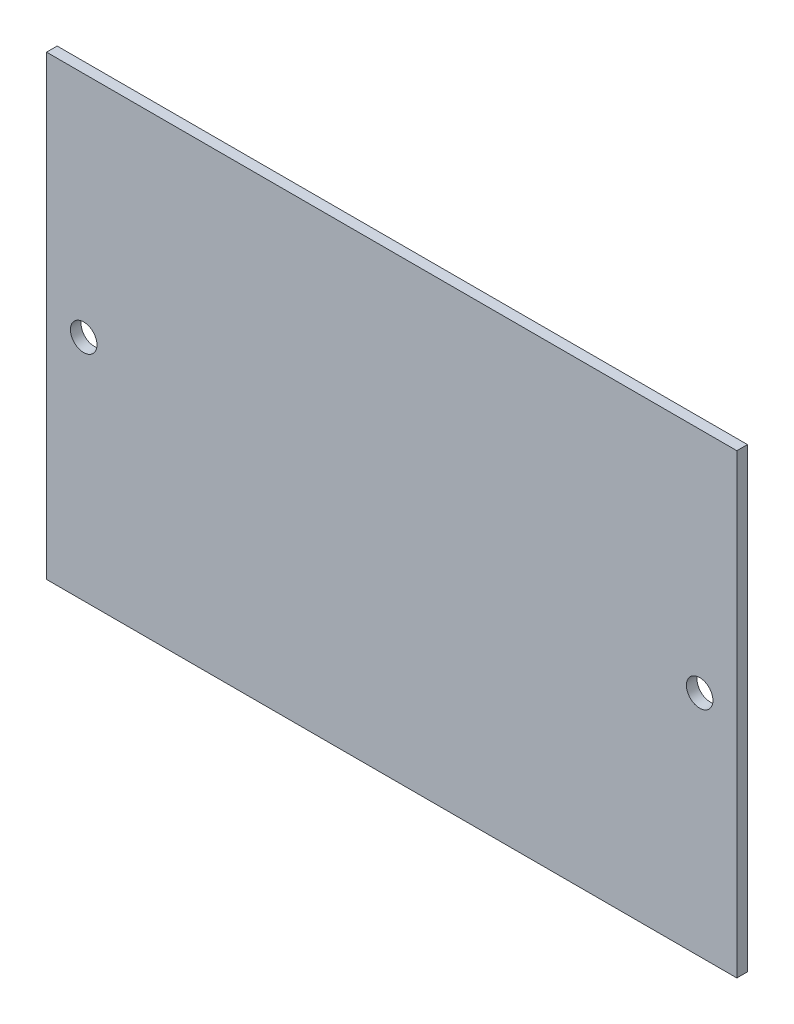
ISO-10303-21;
HEADER;
FILE_DESCRIPTION(('STEP AP214'),'2;1');
FILE_NAME('part.step','',(''),(''),'','','');
FILE_SCHEMA(('AUTOMOTIVE_DESIGN { 1 0 10303 214 1 1 1 1 }'));
ENDSEC;
DATA;
#1=APPLICATION_CONTEXT('core data for automotive mechanical design processes');
#2=APPLICATION_PROTOCOL_DEFINITION('international standard','automotive_design',2000,#1);
#3=PRODUCT_CONTEXT('',#1,'mechanical');
#4=PRODUCT('Part','Part','',(#3));
#5=PRODUCT_RELATED_PRODUCT_CATEGORY('part','',(#4));
#6=PRODUCT_DEFINITION_FORMATION('','',#4);
#7=PRODUCT_DEFINITION_CONTEXT('part definition',#1,'design');
#8=PRODUCT_DEFINITION('design','',#6,#7);
#9=PRODUCT_DEFINITION_SHAPE('','',#8);
#10=(LENGTH_UNIT() NAMED_UNIT(*) SI_UNIT(.MILLI.,.METRE.));
#11=(NAMED_UNIT(*) PLANE_ANGLE_UNIT() SI_UNIT($,.RADIAN.));
#12=(NAMED_UNIT(*) SI_UNIT($,.STERADIAN.) SOLID_ANGLE_UNIT());
#13=UNCERTAINTY_MEASURE_WITH_UNIT(LENGTH_MEASURE(1.E-05),#10,'distance_accuracy_value','');
#14=(GEOMETRIC_REPRESENTATION_CONTEXT(3) GLOBAL_UNCERTAINTY_ASSIGNED_CONTEXT((#13)) GLOBAL_UNIT_ASSIGNED_CONTEXT((#10,
#11,#12)) REPRESENTATION_CONTEXT('',''));
#15=CARTESIAN_POINT('',(0.,0.,0.));
#16=DIRECTION('',(0.,0.,1.));
#17=DIRECTION('',(1.,0.,0.));
#18=AXIS2_PLACEMENT_3D('',#15,#16,#17);
#19=CARTESIAN_POINT('',(0.,0.,2.));
#20=DIRECTION('',(0.,0.,1.));
#21=DIRECTION('',(1.,0.,0.));
#22=AXIS2_PLACEMENT_3D('',#19,#20,#21);
#23=PLANE('',#22);
#24=CARTESIAN_POINT('',(-58.,0.,2.));
#25=DIRECTION('',(0.,0.,1.));
#26=DIRECTION('',(1.,0.,0.));
#27=AXIS2_PLACEMENT_3D('',#24,#25,#26);
#28=CIRCLE('',#27,2.5);
#29=CARTESIAN_POINT('',(-55.5,0.,2.));
#30=VERTEX_POINT('',#29);
#31=EDGE_CURVE('E112',#30,#30,#28,.T.);
#32=ORIENTED_EDGE('',*,*,#31,.F.);
#33=EDGE_LOOP('',(#32));
#34=FACE_BOUND('',#33,.T.);
#35=DIRECTION('',(0.,1.,0.));
#36=VECTOR('',#35,1.);
#37=CARTESIAN_POINT('',(65.,43.,2.));
#38=LINE('',#37,#36);
#39=CARTESIAN_POINT('',(65.,-43.,2.));
#40=VERTEX_POINT('',#39);
#41=CARTESIAN_POINT('',(65.,43.,2.));
#42=VERTEX_POINT('',#41);
#43=EDGE_CURVE('E92',#40,#42,#38,.T.);
#44=ORIENTED_EDGE('',*,*,#43,.T.);
#45=DIRECTION('',(-1.,0.,0.));
#46=VECTOR('',#45,1.);
#47=CARTESIAN_POINT('',(-65.,43.,2.));
#48=LINE('',#47,#46);
#49=CARTESIAN_POINT('',(-65.,43.,2.));
#50=VERTEX_POINT('',#49);
#51=EDGE_CURVE('E87',#42,#50,#48,.T.);
#52=ORIENTED_EDGE('',*,*,#51,.T.);
#53=DIRECTION('',(0.,-1.,0.));
#54=VECTOR('',#53,1.);
#55=CARTESIAN_POINT('',(-65.,43.,2.));
#56=LINE('',#55,#54);
#57=CARTESIAN_POINT('',(-65.,-43.,2.));
#58=VERTEX_POINT('',#57);
#59=EDGE_CURVE('E90',#50,#58,#56,.T.);
#60=ORIENTED_EDGE('',*,*,#59,.T.);
#61=DIRECTION('',(1.,0.,0.));
#62=VECTOR('',#61,1.);
#63=CARTESIAN_POINT('',(-65.,-43.,2.));
#64=LINE('',#63,#62);
#65=EDGE_CURVE('E57',#58,#40,#64,.T.);
#66=ORIENTED_EDGE('',*,*,#65,.T.);
#67=EDGE_LOOP('',(#44,#52,#60,#66));
#68=FACE_BOUND('',#67,.T.);
#69=CARTESIAN_POINT('',(58.,0.,2.));
#70=DIRECTION('',(0.,0.,1.));
#71=DIRECTION('',(1.,0.,0.));
#72=AXIS2_PLACEMENT_3D('',#69,#70,#71);
#73=CIRCLE('',#72,2.5);
#74=CARTESIAN_POINT('',(60.5,0.,2.));
#75=VERTEX_POINT('',#74);
#76=EDGE_CURVE('E134',#75,#75,#73,.T.);
#77=ORIENTED_EDGE('',*,*,#76,.F.);
#78=EDGE_LOOP('',(#77));
#79=FACE_BOUND('',#78,.T.);
#80=ADVANCED_FACE('F39',(#34,#68,#79),#23,.T.);
#81=CARTESIAN_POINT('',(0.,0.,0.));
#82=DIRECTION('',(0.,0.,1.));
#83=DIRECTION('',(1.,0.,0.));
#84=AXIS2_PLACEMENT_3D('',#81,#82,#83);
#85=PLANE('',#84);
#86=DIRECTION('',(0.,1.,0.));
#87=VECTOR('',#86,1.);
#88=CARTESIAN_POINT('',(65.,43.,0.));
#89=LINE('',#88,#87);
#90=CARTESIAN_POINT('',(65.,-43.,0.));
#91=VERTEX_POINT('',#90);
#92=CARTESIAN_POINT('',(65.,43.,0.));
#93=VERTEX_POINT('',#92);
#94=EDGE_CURVE('E108',#91,#93,#89,.T.);
#95=ORIENTED_EDGE('',*,*,#94,.F.);
#96=DIRECTION('',(1.,0.,0.));
#97=VECTOR('',#96,1.);
#98=CARTESIAN_POINT('',(-65.,-43.,0.));
#99=LINE('',#98,#97);
#100=CARTESIAN_POINT('',(-65.,-43.,0.));
#101=VERTEX_POINT('',#100);
#102=EDGE_CURVE('E80',#101,#91,#99,.T.);
#103=ORIENTED_EDGE('',*,*,#102,.F.);
#104=DIRECTION('',(0.,-1.,0.));
#105=VECTOR('',#104,1.);
#106=CARTESIAN_POINT('',(-65.,43.,0.));
#107=LINE('',#106,#105);
#108=CARTESIAN_POINT('',(-65.,43.,0.));
#109=VERTEX_POINT('',#108);
#110=EDGE_CURVE('E74',#109,#101,#107,.T.);
#111=ORIENTED_EDGE('',*,*,#110,.F.);
#112=DIRECTION('',(-1.,0.,0.));
#113=VECTOR('',#112,1.);
#114=CARTESIAN_POINT('',(-65.,43.,0.));
#115=LINE('',#114,#113);
#116=EDGE_CURVE('E97',#93,#109,#115,.T.);
#117=ORIENTED_EDGE('',*,*,#116,.F.);
#118=EDGE_LOOP('',(#95,#103,#111,#117));
#119=FACE_BOUND('',#118,.T.);
#120=CARTESIAN_POINT('',(-58.,0.,0.));
#121=DIRECTION('',(0.,0.,1.));
#122=DIRECTION('',(1.,0.,0.));
#123=AXIS2_PLACEMENT_3D('',#120,#121,#122);
#124=CIRCLE('',#123,2.5);
#125=CARTESIAN_POINT('',(-55.5,0.,0.));
#126=VERTEX_POINT('',#125);
#127=EDGE_CURVE('E130',#126,#126,#124,.T.);
#128=ORIENTED_EDGE('',*,*,#127,.T.);
#129=EDGE_LOOP('',(#128));
#130=FACE_BOUND('',#129,.T.);
#131=CARTESIAN_POINT('',(58.,0.,0.));
#132=DIRECTION('',(0.,0.,1.));
#133=DIRECTION('',(1.,0.,0.));
#134=AXIS2_PLACEMENT_3D('',#131,#132,#133);
#135=CIRCLE('',#134,2.5);
#136=CARTESIAN_POINT('',(60.5,0.,0.));
#137=VERTEX_POINT('',#136);
#138=EDGE_CURVE('E138',#137,#137,#135,.T.);
#139=ORIENTED_EDGE('',*,*,#138,.T.);
#140=EDGE_LOOP('',(#139));
#141=FACE_BOUND('',#140,.T.);
#142=ADVANCED_FACE('F125',(#119,#130,#141),#85,.F.);
#143=CARTESIAN_POINT('',(65.,43.,2.));
#144=DIRECTION('',(-1.,0.,0.));
#145=DIRECTION('',(0.,-1.,0.));
#146=AXIS2_PLACEMENT_3D('',#143,#144,#145);
#147=PLANE('',#146);
#148=ORIENTED_EDGE('',*,*,#94,.T.);
#149=DIRECTION('',(0.,0.,-1.));
#150=VECTOR('',#149,1.);
#151=CARTESIAN_POINT('',(65.,43.,2.));
#152=LINE('',#151,#150);
#153=EDGE_CURVE('E11',#42,#93,#152,.T.);
#154=ORIENTED_EDGE('',*,*,#153,.F.);
#155=ORIENTED_EDGE('',*,*,#43,.F.);
#156=DIRECTION('',(0.,0.,-1.));
#157=VECTOR('',#156,1.);
#158=CARTESIAN_POINT('',(65.,-43.,2.));
#159=LINE('',#158,#157);
#160=EDGE_CURVE('E104',#40,#91,#159,.T.);
#161=ORIENTED_EDGE('',*,*,#160,.T.);
#162=EDGE_LOOP('',(#148,#154,#155,#161));
#163=FACE_BOUND('',#162,.T.);
#164=ADVANCED_FACE('F41',(#163),#147,.F.);
#165=CARTESIAN_POINT('',(-65.,43.,2.));
#166=DIRECTION('',(0.,-1.,0.));
#167=DIRECTION('',(0.,0.,-1.));
#168=AXIS2_PLACEMENT_3D('',#165,#166,#167);
#169=PLANE('',#168);
#170=ORIENTED_EDGE('',*,*,#116,.T.);
#171=DIRECTION('',(0.,0.,-1.));
#172=VECTOR('',#171,1.);
#173=CARTESIAN_POINT('',(-65.,43.,2.));
#174=LINE('',#173,#172);
#175=EDGE_CURVE('E49',#50,#109,#174,.T.);
#176=ORIENTED_EDGE('',*,*,#175,.F.);
#177=ORIENTED_EDGE('',*,*,#51,.F.);
#178=ORIENTED_EDGE('',*,*,#153,.T.);
#179=EDGE_LOOP('',(#170,#176,#177,#178));
#180=FACE_BOUND('',#179,.T.);
#181=ADVANCED_FACE('F96',(#180),#169,.F.);
#182=CARTESIAN_POINT('',(-65.,43.,2.));
#183=DIRECTION('',(1.,0.,0.));
#184=DIRECTION('',(0.,1.,0.));
#185=AXIS2_PLACEMENT_3D('',#182,#183,#184);
#186=PLANE('',#185);
#187=ORIENTED_EDGE('',*,*,#110,.T.);
#188=DIRECTION('',(0.,0.,-1.));
#189=VECTOR('',#188,1.);
#190=CARTESIAN_POINT('',(-65.,-43.,2.));
#191=LINE('',#190,#189);
#192=EDGE_CURVE('E99',#58,#101,#191,.T.);
#193=ORIENTED_EDGE('',*,*,#192,.F.);
#194=ORIENTED_EDGE('',*,*,#59,.F.);
#195=ORIENTED_EDGE('',*,*,#175,.T.);
#196=EDGE_LOOP('',(#187,#193,#194,#195));
#197=FACE_BOUND('',#196,.T.);
#198=ADVANCED_FACE('F100',(#197),#186,.F.);
#199=CARTESIAN_POINT('',(-65.,-43.,2.));
#200=DIRECTION('',(0.,1.,0.));
#201=DIRECTION('',(0.,0.,1.));
#202=AXIS2_PLACEMENT_3D('',#199,#200,#201);
#203=PLANE('',#202);
#204=ORIENTED_EDGE('',*,*,#102,.T.);
#205=ORIENTED_EDGE('',*,*,#160,.F.);
#206=ORIENTED_EDGE('',*,*,#65,.F.);
#207=ORIENTED_EDGE('',*,*,#192,.T.);
#208=EDGE_LOOP('',(#204,#205,#206,#207));
#209=FACE_BOUND('',#208,.T.);
#210=ADVANCED_FACE('F122',(#209),#203,.F.);
#211=CARTESIAN_POINT('',(-58.,0.,2.));
#212=DIRECTION('',(0.,0.,-1.));
#213=DIRECTION('',(-1.,0.,0.));
#214=AXIS2_PLACEMENT_3D('',#211,#212,#213);
#215=CYLINDRICAL_SURFACE('',#214,2.5);
#216=ORIENTED_EDGE('',*,*,#31,.T.);
#217=EDGE_LOOP('',(#216));
#218=FACE_BOUND('',#217,.T.);
#219=ORIENTED_EDGE('',*,*,#127,.F.);
#220=EDGE_LOOP('',(#219));
#221=FACE_BOUND('',#220,.T.);
#222=ADVANCED_FACE('F157',(#218,#221),#215,.F.);
#223=CARTESIAN_POINT('',(58.,0.,2.));
#224=DIRECTION('',(0.,0.,-1.));
#225=DIRECTION('',(-1.,0.,0.));
#226=AXIS2_PLACEMENT_3D('',#223,#224,#225);
#227=CYLINDRICAL_SURFACE('',#226,2.5);
#228=ORIENTED_EDGE('',*,*,#76,.T.);
#229=EDGE_LOOP('',(#228));
#230=FACE_BOUND('',#229,.T.);
#231=ORIENTED_EDGE('',*,*,#138,.F.);
#232=EDGE_LOOP('',(#231));
#233=FACE_BOUND('',#232,.T.);
#234=ADVANCED_FACE('F146',(#230,#233),#227,.F.);
#235=CLOSED_SHELL('',(#80,#142,#164,#181,#198,#210,#222,#234));
#236=MANIFOLD_SOLID_BREP('B2',#235);
#237=ADVANCED_BREP_SHAPE_REPRESENTATION('',(#18,#236),#14);
#238=SHAPE_DEFINITION_REPRESENTATION(#9,#237);
ENDSEC;
END-ISO-10303-21;
